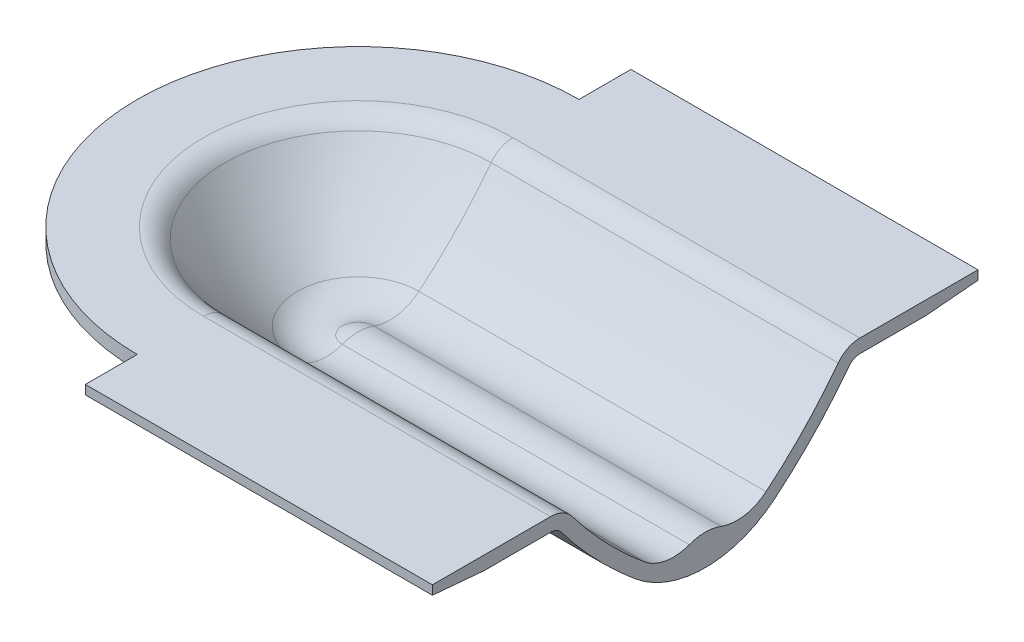
ISO-10303-21;
HEADER;
FILE_DESCRIPTION(('STEP AP214'),'2;1');
FILE_NAME('part.step','',(''),(''),'','','');
FILE_SCHEMA(('AUTOMOTIVE_DESIGN { 1 0 10303 214 1 1 1 1 }'));
ENDSEC;
DATA;
#1=APPLICATION_CONTEXT('core data for automotive mechanical design processes');
#2=APPLICATION_PROTOCOL_DEFINITION('international standard','automotive_design',2000,#1);
#3=PRODUCT_CONTEXT('',#1,'mechanical');
#4=PRODUCT('Part','Part','',(#3));
#5=PRODUCT_RELATED_PRODUCT_CATEGORY('part','',(#4));
#6=PRODUCT_DEFINITION_FORMATION('','',#4);
#7=PRODUCT_DEFINITION_CONTEXT('part definition',#1,'design');
#8=PRODUCT_DEFINITION('design','',#6,#7);
#9=PRODUCT_DEFINITION_SHAPE('','',#8);
#10=(LENGTH_UNIT() NAMED_UNIT(*) SI_UNIT(.MILLI.,.METRE.));
#11=(NAMED_UNIT(*) PLANE_ANGLE_UNIT() SI_UNIT($,.RADIAN.));
#12=(NAMED_UNIT(*) SI_UNIT($,.STERADIAN.) SOLID_ANGLE_UNIT());
#13=UNCERTAINTY_MEASURE_WITH_UNIT(LENGTH_MEASURE(1.E-05),#10,'distance_accuracy_value','');
#14=(GEOMETRIC_REPRESENTATION_CONTEXT(3) GLOBAL_UNCERTAINTY_ASSIGNED_CONTEXT((#13)) GLOBAL_UNIT_ASSIGNED_CONTEXT((#10,
#11,#12)) REPRESENTATION_CONTEXT('',''));
#15=CARTESIAN_POINT('',(0.,0.,0.));
#16=DIRECTION('',(0.,0.,1.));
#17=DIRECTION('',(1.,0.,0.));
#18=AXIS2_PLACEMENT_3D('',#15,#16,#17);
#19=CARTESIAN_POINT('',(-381.999999999999,-30.,-170.25));
#20=DIRECTION('',(1.,0.,0.));
#21=DIRECTION('',(0.,0.,-1.));
#22=AXIS2_PLACEMENT_3D('',#19,#20,#21);
#23=PLANE('',#22);
#24=DIRECTION('',(0.,-1.,0.));
#25=VECTOR('',#24,1.);
#26=CARTESIAN_POINT('',(-381.999999999999,-14.9999999999992,243.099738486189));
#27=LINE('',#26,#25);
#28=CARTESIAN_POINT('',(-381.999999999999,8.00368661311568E-13,243.099738486189));
#29=VERTEX_POINT('',#28);
#30=CARTESIAN_POINT('',(-381.999999999999,-14.9999999999992,243.099738486189));
#31=VERTEX_POINT('',#30);
#32=EDGE_CURVE('E369',#29,#31,#27,.T.);
#33=ORIENTED_EDGE('',*,*,#32,.T.);
#34=DIRECTION('',(0.,-0.0871557427476512,-0.996194698091746));
#35=VECTOR('',#34,1.);
#36=CARTESIAN_POINT('',(-381.999999999999,-10.,300.25));
#37=LINE('',#36,#35);
#38=CARTESIAN_POINT('',(-381.999999999999,-10.,300.25));
#39=VERTEX_POINT('',#38);
#40=EDGE_CURVE('E162',#39,#31,#37,.T.);
#41=ORIENTED_EDGE('',*,*,#40,.F.);
#42=DIRECTION('',(0.,-1.,0.));
#43=VECTOR('',#42,1.);
#44=CARTESIAN_POINT('',(-381.999999999999,0.,300.25));
#45=LINE('',#44,#43);
#46=CARTESIAN_POINT('',(-381.999999999999,0.,300.25));
#47=VERTEX_POINT('',#46);
#48=EDGE_CURVE('E148',#47,#39,#45,.T.);
#49=ORIENTED_EDGE('',*,*,#48,.F.);
#50=DIRECTION('',(0.,0.,1.));
#51=VECTOR('',#50,1.);
#52=CARTESIAN_POINT('',(-381.999999999999,0.,170.25));
#53=LINE('',#52,#51);
#54=EDGE_CURVE('E136',#29,#47,#53,.T.);
#55=ORIENTED_EDGE('',*,*,#54,.F.);
#56=EDGE_LOOP('',(#33,#41,#49,#55));
#57=FACE_BOUND('',#56,.T.);
#58=ADVANCED_FACE('F33',(#57),#23,.F.);
#59=DIRECTION('',(0.,-1.,0.));
#60=VECTOR('',#59,1.);
#61=CARTESIAN_POINT('',(-381.999999999999,-14.9999999999992,-243.099738486189));
#62=LINE('',#61,#60);
#63=CARTESIAN_POINT('',(-381.999999999999,7.99240294431249E-13,-243.099738486189));
#64=VERTEX_POINT('',#63);
#65=CARTESIAN_POINT('',(-381.999999999999,-14.9999999999992,-243.099738486189));
#66=VERTEX_POINT('',#65);
#67=EDGE_CURVE('E287',#64,#66,#62,.T.);
#68=ORIENTED_EDGE('',*,*,#67,.F.);
#69=DIRECTION('',(0.,0.,1.));
#70=VECTOR('',#69,1.);
#71=CARTESIAN_POINT('',(-381.999999999999,0.,-300.25));
#72=LINE('',#71,#70);
#73=CARTESIAN_POINT('',(-381.999999999999,0.,-300.25));
#74=VERTEX_POINT('',#73);
#75=EDGE_CURVE('E288',#74,#64,#72,.T.);
#76=ORIENTED_EDGE('',*,*,#75,.F.);
#77=DIRECTION('',(0.,1.,0.));
#78=VECTOR('',#77,1.);
#79=CARTESIAN_POINT('',(-381.999999999999,0.,-300.25));
#80=LINE('',#79,#78);
#81=CARTESIAN_POINT('',(-381.999999999999,-10.,-300.25));
#82=VERTEX_POINT('',#81);
#83=EDGE_CURVE('E240',#82,#74,#80,.T.);
#84=ORIENTED_EDGE('',*,*,#83,.F.);
#85=DIRECTION('',(0.,0.0871557427476585,-0.996194698091746));
#86=VECTOR('',#85,1.);
#87=CARTESIAN_POINT('',(-381.999999999999,-10.,-300.25));
#88=LINE('',#87,#86);
#89=EDGE_CURVE('E182',#66,#82,#88,.T.);
#90=ORIENTED_EDGE('',*,*,#89,.F.);
#91=EDGE_LOOP('',(#68,#76,#84,#90));
#92=FACE_BOUND('',#91,.T.);
#93=ADVANCED_FACE('F285',(#92),#23,.F.);
#94=CARTESIAN_POINT('',(-381.999999999999,0.,-300.25));
#95=DIRECTION('',(0.,0.,-1.));
#96=DIRECTION('',(-1.,0.,0.));
#97=AXIS2_PLACEMENT_3D('',#94,#95,#96);
#98=PLANE('',#97);
#99=DIRECTION('',(0.,1.,0.));
#100=VECTOR('',#99,1.);
#101=CARTESIAN_POINT('',(0.,0.,-300.25));
#102=LINE('',#101,#100);
#103=CARTESIAN_POINT('',(0.,-10.,-300.25));
#104=VERTEX_POINT('',#103);
#105=CARTESIAN_POINT('',(0.,0.,-300.25));
#106=VERTEX_POINT('',#105);
#107=EDGE_CURVE('E184',#104,#106,#102,.T.);
#108=ORIENTED_EDGE('',*,*,#107,.F.);
#109=DIRECTION('',(1.,0.,0.));
#110=VECTOR('',#109,1.);
#111=CARTESIAN_POINT('',(-381.999999999999,-10.,-300.25));
#112=LINE('',#111,#110);
#113=EDGE_CURVE('E11',#82,#104,#112,.T.);
#114=ORIENTED_EDGE('',*,*,#113,.F.);
#115=ORIENTED_EDGE('',*,*,#83,.T.);
#116=DIRECTION('',(1.,0.,0.));
#117=VECTOR('',#116,1.);
#118=CARTESIAN_POINT('',(-381.999999999999,0.,-300.25));
#119=LINE('',#118,#117);
#120=EDGE_CURVE('E37',#74,#106,#119,.T.);
#121=ORIENTED_EDGE('',*,*,#120,.T.);
#122=EDGE_LOOP('',(#108,#114,#115,#121));
#123=FACE_BOUND('',#122,.T.);
#124=ADVANCED_FACE('F35',(#123),#98,.T.);
#125=CARTESIAN_POINT('',(-381.999999999999,-10.,-300.25));
#126=DIRECTION('',(0.,-0.996194698091746,-0.0871557427476585));
#127=DIRECTION('',(0.,0.0871557427476585,-0.996194698091746));
#128=AXIS2_PLACEMENT_3D('',#125,#126,#127);
#129=PLANE('',#128);
#130=DIRECTION('',(0.,0.0871557427476585,-0.996194698091746));
#131=VECTOR('',#130,1.);
#132=CARTESIAN_POINT('',(0.,-10.,-300.25));
#133=LINE('',#132,#131);
#134=CARTESIAN_POINT('',(0.,-15.,-243.099738486193));
#135=VERTEX_POINT('',#134);
#136=EDGE_CURVE('E238',#135,#104,#133,.T.);
#137=ORIENTED_EDGE('',*,*,#136,.F.);
#138=DIRECTION('',(1.,0.,0.));
#139=VECTOR('',#138,1.);
#140=CARTESIAN_POINT('',(-381.999999999999,-15.,-243.099738486193));
#141=LINE('',#140,#139);
#142=EDGE_CURVE('E43',#66,#135,#141,.T.);
#143=ORIENTED_EDGE('',*,*,#142,.F.);
#144=ORIENTED_EDGE('',*,*,#89,.T.);
#145=ORIENTED_EDGE('',*,*,#113,.T.);
#146=EDGE_LOOP('',(#137,#143,#144,#145));
#147=FACE_BOUND('',#146,.T.);
#148=ADVANCED_FACE('F277',(#147),#129,.T.);
#149=CARTESIAN_POINT('',(-381.999999999999,-15.,-243.099738486193));
#150=DIRECTION('',(0.,-1.,0.));
#151=DIRECTION('',(0.,0.,-1.));
#152=AXIS2_PLACEMENT_3D('',#149,#150,#151);
#153=PLANE('',#152);
#154=DIRECTION('',(0.,0.,-1.));
#155=VECTOR('',#154,1.);
#156=CARTESIAN_POINT('',(0.,-15.,-243.099738486193));
#157=LINE('',#156,#155);
#158=CARTESIAN_POINT('',(0.,-15.,-170.25));
#159=VERTEX_POINT('',#158);
#160=EDGE_CURVE('E236',#159,#135,#157,.T.);
#161=ORIENTED_EDGE('',*,*,#160,.F.);
#162=DIRECTION('',(1.,0.,0.));
#163=VECTOR('',#162,1.);
#164=CARTESIAN_POINT('',(-381.999999999999,-15.,-170.25));
#165=LINE('',#164,#163);
#166=CARTESIAN_POINT('',(-381.999999999999,-14.9999999999979,-170.25));
#167=VERTEX_POINT('',#166);
#168=EDGE_CURVE('E243',#167,#159,#165,.T.);
#169=ORIENTED_EDGE('',*,*,#168,.F.);
#170=CARTESIAN_POINT('',(-382.,-14.9999999999979,0.));
#171=DIRECTION('',(0.,-1.,0.));
#172=DIRECTION('',(1.,0.,0.));
#173=AXIS2_PLACEMENT_3D('',#170,#171,#172);
#174=CIRCLE('',#173,170.25);
#175=CARTESIAN_POINT('',(-381.999999999999,-14.9999999999979,170.25));
#176=VERTEX_POINT('',#175);
#177=EDGE_CURVE('E466',#176,#167,#174,.T.);
#178=ORIENTED_EDGE('',*,*,#177,.F.);
#179=DIRECTION('',(1.,0.,0.));
#180=VECTOR('',#179,1.);
#181=CARTESIAN_POINT('',(-381.999999999999,-14.9999999999971,170.25));
#182=LINE('',#181,#180);
#183=CARTESIAN_POINT('',(0.,-14.9999999999971,170.25));
#184=VERTEX_POINT('',#183);
#185=EDGE_CURVE('E253',#176,#184,#182,.T.);
#186=ORIENTED_EDGE('',*,*,#185,.T.);
#187=DIRECTION('',(0.,0.,-1.));
#188=VECTOR('',#187,1.);
#189=CARTESIAN_POINT('',(0.,-14.9999999999971,170.25));
#190=LINE('',#189,#188);
#191=CARTESIAN_POINT('',(0.,-15.,243.099738486189));
#192=VERTEX_POINT('',#191);
#193=EDGE_CURVE('E218',#192,#184,#190,.T.);
#194=ORIENTED_EDGE('',*,*,#193,.F.);
#195=DIRECTION('',(1.,0.,0.));
#196=VECTOR('',#195,1.);
#197=CARTESIAN_POINT('',(-381.999999999999,-15.,243.099738486189));
#198=LINE('',#197,#196);
#199=EDGE_CURVE('E255',#31,#192,#198,.T.);
#200=ORIENTED_EDGE('',*,*,#199,.F.);
#201=CARTESIAN_POINT('',(-382.,-14.9999999999992,0.));
#202=DIRECTION('',(0.,-1.,0.));
#203=DIRECTION('',(1.,0.,0.));
#204=AXIS2_PLACEMENT_3D('',#201,#202,#203);
#205=CIRCLE('',#204,243.099738486189);
#206=EDGE_CURVE('E469',#31,#66,#205,.T.);
#207=ORIENTED_EDGE('',*,*,#206,.T.);
#208=ORIENTED_EDGE('',*,*,#142,.T.);
#209=EDGE_LOOP('',(#161,#169,#178,#186,#194,#200,#207,#208));
#210=FACE_BOUND('',#209,.T.);
#211=ADVANCED_FACE('F404',(#210),#153,.T.);
#212=CARTESIAN_POINT('',(-381.999999999999,-30.,-170.25));
#213=DIRECTION('',(1.,0.,0.));
#214=DIRECTION('',(0.,0.,-1.));
#215=AXIS2_PLACEMENT_3D('',#212,#213,#214);
#216=CYLINDRICAL_SURFACE('',#215,15.);
#217=CARTESIAN_POINT('',(0.,-30.,-170.25));
#218=DIRECTION('',(-1.,0.,0.));
#219=DIRECTION('',(0.,0.,-1.));
#220=AXIS2_PLACEMENT_3D('',#217,#218,#219);
#221=CIRCLE('',#220,15.);
#222=CARTESIAN_POINT('',(0.,-20.9378309151861,-158.296879425094));
#223=VERTEX_POINT('',#222);
#224=EDGE_CURVE('E233',#223,#159,#221,.T.);
#225=ORIENTED_EDGE('',*,*,#224,.F.);
#226=DIRECTION('',(1.,0.,0.));
#227=VECTOR('',#226,1.);
#228=CARTESIAN_POINT('',(-381.999999999999,-20.9378309151861,-158.296879425094));
#229=LINE('',#228,#227);
#230=CARTESIAN_POINT('',(-381.999999999999,-20.9378309151853,-158.296879425093));
#231=VERTEX_POINT('',#230);
#232=EDGE_CURVE('E245',#231,#223,#229,.T.);
#233=ORIENTED_EDGE('',*,*,#232,.F.);
#234=CARTESIAN_POINT('',(-381.999999999999,-30.,-170.25));
#235=DIRECTION('',(-1.,0.,0.));
#236=DIRECTION('',(0.,0.,-1.));
#237=AXIS2_PLACEMENT_3D('',#234,#235,#236);
#238=CIRCLE('',#237,15.);
#239=EDGE_CURVE('E179',#231,#167,#238,.T.);
#240=ORIENTED_EDGE('',*,*,#239,.T.);
#241=ORIENTED_EDGE('',*,*,#168,.T.);
#242=EDGE_LOOP('',(#225,#233,#240,#241));
#243=FACE_BOUND('',#242,.T.);
#244=ADVANCED_FACE('F407',(#243),#216,.F.);
#245=CARTESIAN_POINT('',(-381.999999999999,290.196640996754,252.093593646685));
#246=DIRECTION('',(1.,0.,0.));
#247=DIRECTION('',(0.,0.,-1.));
#248=AXIS2_PLACEMENT_3D('',#245,#246,#247);
#249=CYLINDRICAL_SURFACE('',#248,515.);
#250=CARTESIAN_POINT('',(0.,290.196640996754,252.093593646685));
#251=DIRECTION('',(1.,0.,0.));
#252=DIRECTION('',(0.,0.,1.));
#253=AXIS2_PLACEMENT_3D('',#250,#251,#252);
#254=CIRCLE('',#253,515.);
#255=CARTESIAN_POINT('',(0.,-106.378160282581,-76.4690746378544));
#256=VERTEX_POINT('',#255);
#257=EDGE_CURVE('E230',#256,#223,#254,.T.);
#258=ORIENTED_EDGE('',*,*,#257,.F.);
#259=DIRECTION('',(1.,0.,0.));
#260=VECTOR('',#259,1.);
#261=CARTESIAN_POINT('',(-381.999999999999,-106.378160282581,-76.4690746378544));
#262=LINE('',#261,#260);
#263=CARTESIAN_POINT('',(-381.999999999999,-106.378160282581,-76.4690746378548));
#264=VERTEX_POINT('',#263);
#265=EDGE_CURVE('E247',#264,#256,#262,.T.);
#266=ORIENTED_EDGE('',*,*,#265,.F.);
#267=CARTESIAN_POINT('',(-381.999999999999,290.196640996754,252.093593646685));
#268=DIRECTION('',(1.,0.,0.));
#269=DIRECTION('',(0.,0.,1.));
#270=AXIS2_PLACEMENT_3D('',#267,#268,#269);
#271=CIRCLE('',#270,515.);
#272=EDGE_CURVE('E176',#264,#231,#271,.T.);
#273=ORIENTED_EDGE('',*,*,#272,.T.);
#274=ORIENTED_EDGE('',*,*,#232,.T.);
#275=EDGE_LOOP('',(#258,#266,#273,#274));
#276=FACE_BOUND('',#275,.T.);
#277=ADVANCED_FACE('F410',(#276),#249,.T.);
#278=CARTESIAN_POINT('',(-381.999999999999,-14.0800661720858,0.));
#279=DIRECTION('',(1.,0.,0.));
#280=DIRECTION('',(0.,0.,-1.));
#281=AXIS2_PLACEMENT_3D('',#278,#279,#280);
#282=CYLINDRICAL_SURFACE('',#281,119.8601583196);
#283=CARTESIAN_POINT('',(0.,-14.0800661720858,0.));
#284=DIRECTION('',(1.,0.,0.));
#285=DIRECTION('',(0.,0.,1.));
#286=AXIS2_PLACEMENT_3D('',#283,#284,#285);
#287=CIRCLE('',#286,119.8601583196);
#288=CARTESIAN_POINT('',(0.,-106.378160282581,76.4690746378544));
#289=VERTEX_POINT('',#288);
#290=EDGE_CURVE('E227',#289,#256,#287,.T.);
#291=ORIENTED_EDGE('',*,*,#290,.F.);
#292=DIRECTION('',(1.,0.,0.));
#293=VECTOR('',#292,1.);
#294=CARTESIAN_POINT('',(-381.999999999999,-106.378160282581,76.4690746378544));
#295=LINE('',#294,#293);
#296=CARTESIAN_POINT('',(-381.999999999999,-106.378160282581,76.4690746378548));
#297=VERTEX_POINT('',#296);
#298=EDGE_CURVE('E249',#297,#289,#295,.T.);
#299=ORIENTED_EDGE('',*,*,#298,.F.);
#300=CARTESIAN_POINT('',(-381.999999999999,-14.0800661720858,0.));
#301=DIRECTION('',(1.,0.,0.));
#302=DIRECTION('',(0.,0.,1.));
#303=AXIS2_PLACEMENT_3D('',#300,#301,#302);
#304=CIRCLE('',#303,119.8601583196);
#305=EDGE_CURVE('E173',#297,#264,#304,.T.);
#306=ORIENTED_EDGE('',*,*,#305,.T.);
#307=ORIENTED_EDGE('',*,*,#265,.T.);
#308=EDGE_LOOP('',(#291,#299,#306,#307));
#309=FACE_BOUND('',#308,.T.);
#310=ADVANCED_FACE('F414',(#309),#282,.T.);
#311=CARTESIAN_POINT('',(-381.999999999999,290.196640996754,-252.093593646685));
#312=DIRECTION('',(1.,0.,0.));
#313=DIRECTION('',(0.,0.,-1.));
#314=AXIS2_PLACEMENT_3D('',#311,#312,#313);
#315=CYLINDRICAL_SURFACE('',#314,515.);
#316=CARTESIAN_POINT('',(0.,290.196640996754,-252.093593646685));
#317=DIRECTION('',(1.,0.,0.));
#318=DIRECTION('',(0.,0.,1.));
#319=AXIS2_PLACEMENT_3D('',#316,#317,#318);
#320=CIRCLE('',#319,515.);
#321=CARTESIAN_POINT('',(0.,-20.9378309151852,158.296879425093));
#322=VERTEX_POINT('',#321);
#323=EDGE_CURVE('E224',#322,#289,#320,.T.);
#324=ORIENTED_EDGE('',*,*,#323,.F.);
#325=DIRECTION('',(1.,0.,0.));
#326=VECTOR('',#325,1.);
#327=CARTESIAN_POINT('',(-381.999999999999,-20.9378309151852,158.296879425093));
#328=LINE('',#327,#326);
#329=CARTESIAN_POINT('',(-381.999999999999,-20.9378309151853,158.296879425093));
#330=VERTEX_POINT('',#329);
#331=EDGE_CURVE('E251',#330,#322,#328,.T.);
#332=ORIENTED_EDGE('',*,*,#331,.F.);
#333=CARTESIAN_POINT('',(-381.999999999999,290.196640996754,-252.093593646685));
#334=DIRECTION('',(1.,0.,0.));
#335=DIRECTION('',(0.,0.,1.));
#336=AXIS2_PLACEMENT_3D('',#333,#334,#335);
#337=CIRCLE('',#336,515.);
#338=EDGE_CURVE('E170',#330,#297,#337,.T.);
#339=ORIENTED_EDGE('',*,*,#338,.T.);
#340=ORIENTED_EDGE('',*,*,#298,.T.);
#341=EDGE_LOOP('',(#324,#332,#339,#340));
#342=FACE_BOUND('',#341,.T.);
#343=ADVANCED_FACE('F418',(#342),#315,.T.);
#344=CARTESIAN_POINT('',(-381.999999999999,-30.,170.25));
#345=DIRECTION('',(1.,0.,0.));
#346=DIRECTION('',(0.,0.,-1.));
#347=AXIS2_PLACEMENT_3D('',#344,#345,#346);
#348=CYLINDRICAL_SURFACE('',#347,15.0000000000014);
#349=CARTESIAN_POINT('',(0.,-30.,170.25));
#350=DIRECTION('',(-1.,0.,0.));
#351=DIRECTION('',(0.,0.,1.));
#352=AXIS2_PLACEMENT_3D('',#349,#350,#351);
#353=CIRCLE('',#352,15.0000000000014);
#354=EDGE_CURVE('E221',#184,#322,#353,.T.);
#355=ORIENTED_EDGE('',*,*,#354,.F.);
#356=ORIENTED_EDGE('',*,*,#185,.F.);
#357=CARTESIAN_POINT('',(-381.999999999999,-30.,170.25));
#358=DIRECTION('',(-1.,0.,0.));
#359=DIRECTION('',(0.,0.,1.));
#360=AXIS2_PLACEMENT_3D('',#357,#358,#359);
#361=CIRCLE('',#360,15.0000000000014);
#362=EDGE_CURVE('E164',#176,#330,#361,.T.);
#363=ORIENTED_EDGE('',*,*,#362,.T.);
#364=ORIENTED_EDGE('',*,*,#331,.T.);
#365=EDGE_LOOP('',(#355,#356,#363,#364));
#366=FACE_BOUND('',#365,.T.);
#367=ADVANCED_FACE('F422',(#366),#348,.F.);
#368=CARTESIAN_POINT('',(-381.999999999999,-10.,300.25));
#369=DIRECTION('',(0.,-0.996194698091746,0.0871557427476512));
#370=DIRECTION('',(0.,-0.0871557427476512,-0.996194698091746));
#371=AXIS2_PLACEMENT_3D('',#368,#369,#370);
#372=PLANE('',#371);
#373=DIRECTION('',(0.,-0.0871557427476512,-0.996194698091746));
#374=VECTOR('',#373,1.);
#375=CARTESIAN_POINT('',(0.,-10.,300.25));
#376=LINE('',#375,#374);
#377=CARTESIAN_POINT('',(0.,-10.,300.25));
#378=VERTEX_POINT('',#377);
#379=EDGE_CURVE('E215',#378,#192,#376,.T.);
#380=ORIENTED_EDGE('',*,*,#379,.F.);
#381=DIRECTION('',(1.,0.,0.));
#382=VECTOR('',#381,1.);
#383=CARTESIAN_POINT('',(-381.999999999999,-10.,300.25));
#384=LINE('',#383,#382);
#385=EDGE_CURVE('E157',#39,#378,#384,.T.);
#386=ORIENTED_EDGE('',*,*,#385,.F.);
#387=ORIENTED_EDGE('',*,*,#40,.T.);
#388=ORIENTED_EDGE('',*,*,#199,.T.);
#389=EDGE_LOOP('',(#380,#386,#387,#388));
#390=FACE_BOUND('',#389,.T.);
#391=ADVANCED_FACE('F426',(#390),#372,.T.);
#392=CARTESIAN_POINT('',(-381.999999999999,0.,300.25));
#393=DIRECTION('',(0.,0.,1.));
#394=DIRECTION('',(1.,0.,0.));
#395=AXIS2_PLACEMENT_3D('',#392,#393,#394);
#396=PLANE('',#395);
#397=DIRECTION('',(0.,-1.,0.));
#398=VECTOR('',#397,1.);
#399=CARTESIAN_POINT('',(0.,0.,300.25));
#400=LINE('',#399,#398);
#401=CARTESIAN_POINT('',(0.,0.,300.25));
#402=VERTEX_POINT('',#401);
#403=EDGE_CURVE('E155',#402,#378,#400,.T.);
#404=ORIENTED_EDGE('',*,*,#403,.F.);
#405=DIRECTION('',(1.,0.,0.));
#406=VECTOR('',#405,1.);
#407=CARTESIAN_POINT('',(-381.999999999999,0.,300.25));
#408=LINE('',#407,#406);
#409=EDGE_CURVE('E139',#47,#402,#408,.T.);
#410=ORIENTED_EDGE('',*,*,#409,.F.);
#411=ORIENTED_EDGE('',*,*,#48,.T.);
#412=ORIENTED_EDGE('',*,*,#385,.T.);
#413=EDGE_LOOP('',(#404,#410,#411,#412));
#414=FACE_BOUND('',#413,.T.);
#415=ADVANCED_FACE('F153',(#414),#396,.T.);
#416=CARTESIAN_POINT('',(-381.999999999999,0.,220.25));
#417=DIRECTION('',(0.,1.,0.));
#418=DIRECTION('',(0.,0.,1.));
#419=AXIS2_PLACEMENT_3D('',#416,#417,#418);
#420=PLANE('',#419);
#421=DIRECTION('',(0.,0.,1.));
#422=VECTOR('',#421,1.);
#423=CARTESIAN_POINT('',(0.,0.,220.25));
#424=LINE('',#423,#422);
#425=CARTESIAN_POINT('',(0.,0.,170.25));
#426=VERTEX_POINT('',#425);
#427=EDGE_CURVE('E212',#426,#402,#424,.T.);
#428=ORIENTED_EDGE('',*,*,#427,.F.);
#429=DIRECTION('',(1.,0.,0.));
#430=VECTOR('',#429,1.);
#431=CARTESIAN_POINT('',(-381.999999999999,0.,170.25));
#432=LINE('',#431,#430);
#433=CARTESIAN_POINT('',(-381.999999999999,6.07171760307322E-13,170.25));
#434=VERTEX_POINT('',#433);
#435=EDGE_CURVE('E158',#434,#426,#432,.T.);
#436=ORIENTED_EDGE('',*,*,#435,.F.);
#437=CARTESIAN_POINT('',(-382.,6.10622663543836E-13,0.));
#438=DIRECTION('',(0.,-1.,0.));
#439=DIRECTION('',(1.,0.,0.));
#440=AXIS2_PLACEMENT_3D('',#437,#438,#439);
#441=CIRCLE('',#440,170.25);
#442=CARTESIAN_POINT('',(-381.999999999999,6.06043393427003E-13,-170.25));
#443=VERTEX_POINT('',#442);
#444=EDGE_CURVE('E328',#434,#443,#441,.T.);
#445=ORIENTED_EDGE('',*,*,#444,.T.);
#446=DIRECTION('',(1.,0.,0.));
#447=VECTOR('',#446,1.);
#448=CARTESIAN_POINT('',(-381.999999999999,0.,-170.25));
#449=LINE('',#448,#447);
#450=CARTESIAN_POINT('',(0.,0.,-170.25));
#451=VERTEX_POINT('',#450);
#452=EDGE_CURVE('E271',#443,#451,#449,.T.);
#453=ORIENTED_EDGE('',*,*,#452,.T.);
#454=DIRECTION('',(0.,0.,1.));
#455=VECTOR('',#454,1.);
#456=CARTESIAN_POINT('',(0.,0.,-300.25));
#457=LINE('',#456,#455);
#458=EDGE_CURVE('E187',#106,#451,#457,.T.);
#459=ORIENTED_EDGE('',*,*,#458,.F.);
#460=ORIENTED_EDGE('',*,*,#120,.F.);
#461=ORIENTED_EDGE('',*,*,#75,.T.);
#462=CARTESIAN_POINT('',(-382.,8.04911692853238E-13,0.));
#463=DIRECTION('',(0.,-1.,0.));
#464=DIRECTION('',(1.,0.,0.));
#465=AXIS2_PLACEMENT_3D('',#462,#463,#464);
#466=CIRCLE('',#465,243.099738486189);
#467=EDGE_CURVE('E143',#29,#64,#466,.T.);
#468=ORIENTED_EDGE('',*,*,#467,.F.);
#469=ORIENTED_EDGE('',*,*,#54,.T.);
#470=ORIENTED_EDGE('',*,*,#409,.T.);
#471=EDGE_LOOP('',(#428,#436,#445,#453,#459,#460,#461,#468,#469,#470));
#472=FACE_BOUND('',#471,.T.);
#473=ADVANCED_FACE('F138',(#472),#420,.T.);
#474=CARTESIAN_POINT('',(-381.999999999999,-30.,170.25));
#475=DIRECTION('',(1.,0.,0.));
#476=DIRECTION('',(0.,0.,-1.));
#477=AXIS2_PLACEMENT_3D('',#474,#475,#476);
#478=CYLINDRICAL_SURFACE('',#477,30.);
#479=CARTESIAN_POINT('',(0.,-30.,170.25));
#480=DIRECTION('',(1.,0.,0.));
#481=DIRECTION('',(0.,0.,1.));
#482=AXIS2_PLACEMENT_3D('',#479,#480,#481);
#483=CIRCLE('',#482,30.);
#484=CARTESIAN_POINT('',(0.,-11.8756618303724,146.343758850187));
#485=VERTEX_POINT('',#484);
#486=EDGE_CURVE('E209',#485,#426,#483,.T.);
#487=ORIENTED_EDGE('',*,*,#486,.F.);
#488=DIRECTION('',(1.,0.,0.));
#489=VECTOR('',#488,1.);
#490=CARTESIAN_POINT('',(-381.999999999999,-11.8756618303724,146.343758850187));
#491=LINE('',#490,#489);
#492=CARTESIAN_POINT('',(-381.999999999999,-11.875661830372,146.343758850187));
#493=VERTEX_POINT('',#492);
#494=EDGE_CURVE('E260',#493,#485,#491,.T.);
#495=ORIENTED_EDGE('',*,*,#494,.F.);
#496=CARTESIAN_POINT('',(-381.999999999999,-30.,170.25));
#497=DIRECTION('',(1.,0.,0.));
#498=DIRECTION('',(0.,0.,1.));
#499=AXIS2_PLACEMENT_3D('',#496,#497,#498);
#500=CIRCLE('',#499,30.);
#501=EDGE_CURVE('E149',#493,#434,#500,.T.);
#502=ORIENTED_EDGE('',*,*,#501,.T.);
#503=ORIENTED_EDGE('',*,*,#435,.T.);
#504=EDGE_LOOP('',(#487,#495,#502,#503));
#505=FACE_BOUND('',#504,.T.);
#506=ADVANCED_FACE('F316',(#505),#478,.T.);
#507=CARTESIAN_POINT('',(-381.999999999999,290.196640996754,-252.093593646685));
#508=DIRECTION('',(1.,0.,0.));
#509=DIRECTION('',(0.,0.,-1.));
#510=AXIS2_PLACEMENT_3D('',#507,#508,#509);
#511=CYLINDRICAL_SURFACE('',#510,500.);
#512=CARTESIAN_POINT('',(0.,290.196640996754,-252.093593646685));
#513=DIRECTION('',(-1.,0.,0.));
#514=DIRECTION('',(0.,0.,1.));
#515=AXIS2_PLACEMENT_3D('',#512,#513,#514);
#516=CIRCLE('',#515,500.);
#517=CARTESIAN_POINT('',(0.,-94.8274379152218,66.8992881829652));
#518=VERTEX_POINT('',#517);
#519=EDGE_CURVE('E206',#518,#485,#516,.T.);
#520=ORIENTED_EDGE('',*,*,#519,.F.);
#521=DIRECTION('',(1.,0.,0.));
#522=VECTOR('',#521,1.);
#523=CARTESIAN_POINT('',(-381.999999999999,-94.8274379152218,66.8992881829652));
#524=LINE('',#523,#522);
#525=CARTESIAN_POINT('',(-381.999999999999,-94.8274379152217,66.8992881829655));
#526=VERTEX_POINT('',#525);
#527=EDGE_CURVE('E262',#526,#518,#524,.T.);
#528=ORIENTED_EDGE('',*,*,#527,.F.);
#529=CARTESIAN_POINT('',(-381.999999999999,290.196640996754,-252.093593646685));
#530=DIRECTION('',(-1.,0.,0.));
#531=DIRECTION('',(0.,0.,1.));
#532=AXIS2_PLACEMENT_3D('',#529,#530,#531);
#533=CIRCLE('',#532,500.);
#534=EDGE_CURVE('E308',#526,#493,#533,.T.);
#535=ORIENTED_EDGE('',*,*,#534,.T.);
#536=ORIENTED_EDGE('',*,*,#494,.T.);
#537=EDGE_LOOP('',(#520,#528,#535,#536));
#538=FACE_BOUND('',#537,.T.);
#539=ADVANCED_FACE('F373',(#538),#511,.F.);
#540=CARTESIAN_POINT('',(-381.999999999999,-56.325030024024,35.));
#541=DIRECTION('',(1.,0.,0.));
#542=DIRECTION('',(0.,0.,-1.));
#543=AXIS2_PLACEMENT_3D('',#540,#541,#542);
#544=CYLINDRICAL_SURFACE('',#543,50.0000000000003);
#545=CARTESIAN_POINT('',(0.,-56.325030024024,35.));
#546=DIRECTION('',(-1.,0.,0.));
#547=DIRECTION('',(0.,0.,1.));
#548=AXIS2_PLACEMENT_3D('',#545,#546,#547);
#549=CIRCLE('',#548,50.0000000000003);
#550=CARTESIAN_POINT('',(0.,-103.162515012012,17.4999999999984));
#551=VERTEX_POINT('',#550);
#552=EDGE_CURVE('E203',#551,#518,#549,.T.);
#553=ORIENTED_EDGE('',*,*,#552,.F.);
#554=DIRECTION('',(1.,0.,0.));
#555=VECTOR('',#554,1.);
#556=CARTESIAN_POINT('',(-381.999999999999,-103.162515012012,17.4999999999984));
#557=LINE('',#556,#555);
#558=CARTESIAN_POINT('',(-381.999999999999,-103.162515012012,17.4999999999986));
#559=VERTEX_POINT('',#558);
#560=EDGE_CURVE('E264',#559,#551,#557,.T.);
#561=ORIENTED_EDGE('',*,*,#560,.F.);
#562=CARTESIAN_POINT('',(-381.999999999999,-56.325030024024,35.));
#563=DIRECTION('',(-1.,0.,0.));
#564=DIRECTION('',(0.,0.,1.));
#565=AXIS2_PLACEMENT_3D('',#562,#563,#564);
#566=CIRCLE('',#565,50.0000000000003);
#567=EDGE_CURVE('E305',#559,#526,#566,.T.);
#568=ORIENTED_EDGE('',*,*,#567,.T.);
#569=ORIENTED_EDGE('',*,*,#527,.T.);
#570=EDGE_LOOP('',(#553,#561,#568,#569));
#571=FACE_BOUND('',#570,.T.);
#572=ADVANCED_FACE('F361',(#571),#544,.F.);
#573=CARTESIAN_POINT('',(-381.999999999999,-150.,0.));
#574=DIRECTION('',(1.,0.,0.));
#575=DIRECTION('',(0.,0.,-1.));
#576=AXIS2_PLACEMENT_3D('',#573,#574,#575);
#577=CYLINDRICAL_SURFACE('',#576,49.9999999999994);
#578=CARTESIAN_POINT('',(0.,-150.,0.));
#579=DIRECTION('',(1.,0.,0.));
#580=DIRECTION('',(0.,0.,-1.));
#581=AXIS2_PLACEMENT_3D('',#578,#579,#580);
#582=CIRCLE('',#581,49.9999999999994);
#583=CARTESIAN_POINT('',(0.,-103.162515012012,-17.4999999999985));
#584=VERTEX_POINT('',#583);
#585=EDGE_CURVE('E200',#584,#551,#582,.T.);
#586=ORIENTED_EDGE('',*,*,#585,.F.);
#587=DIRECTION('',(1.,0.,0.));
#588=VECTOR('',#587,1.);
#589=CARTESIAN_POINT('',(-381.999999999999,-103.162515012012,-17.4999999999985));
#590=LINE('',#589,#588);
#591=CARTESIAN_POINT('',(-381.999999999999,-103.162515012012,-17.4999999999985));
#592=VERTEX_POINT('',#591);
#593=EDGE_CURVE('E266',#592,#584,#590,.T.);
#594=ORIENTED_EDGE('',*,*,#593,.F.);
#595=CARTESIAN_POINT('',(-381.999999999999,-150.,0.));
#596=DIRECTION('',(1.,0.,0.));
#597=DIRECTION('',(0.,0.,-1.));
#598=AXIS2_PLACEMENT_3D('',#595,#596,#597);
#599=CIRCLE('',#598,49.9999999999994);
#600=EDGE_CURVE('E302',#592,#559,#599,.T.);
#601=ORIENTED_EDGE('',*,*,#600,.T.);
#602=ORIENTED_EDGE('',*,*,#560,.T.);
#603=EDGE_LOOP('',(#586,#594,#601,#602));
#604=FACE_BOUND('',#603,.T.);
#605=ADVANCED_FACE('F378',(#604),#577,.T.);
#606=CARTESIAN_POINT('',(-381.999999999999,-56.325030024024,-35.));
#607=DIRECTION('',(1.,0.,0.));
#608=DIRECTION('',(0.,0.,-1.));
#609=AXIS2_PLACEMENT_3D('',#606,#607,#608);
#610=CYLINDRICAL_SURFACE('',#609,50.0000000000003);
#611=CARTESIAN_POINT('',(0.,-56.325030024024,-35.));
#612=DIRECTION('',(-1.,0.,0.));
#613=DIRECTION('',(0.,0.,1.));
#614=AXIS2_PLACEMENT_3D('',#611,#612,#613);
#615=CIRCLE('',#614,50.0000000000003);
#616=CARTESIAN_POINT('',(0.,-94.8274379152215,-66.899288182965));
#617=VERTEX_POINT('',#616);
#618=EDGE_CURVE('E197',#617,#584,#615,.T.);
#619=ORIENTED_EDGE('',*,*,#618,.F.);
#620=DIRECTION('',(1.,0.,0.));
#621=VECTOR('',#620,1.);
#622=CARTESIAN_POINT('',(-381.999999999999,-94.8274379152215,-66.899288182965));
#623=LINE('',#622,#621);
#624=CARTESIAN_POINT('',(-381.999999999999,-94.8274379152217,-66.8992881829655));
#625=VERTEX_POINT('',#624);
#626=EDGE_CURVE('E268',#625,#617,#623,.T.);
#627=ORIENTED_EDGE('',*,*,#626,.F.);
#628=CARTESIAN_POINT('',(-381.999999999999,-56.325030024024,-35.));
#629=DIRECTION('',(-1.,0.,0.));
#630=DIRECTION('',(0.,0.,1.));
#631=AXIS2_PLACEMENT_3D('',#628,#629,#630);
#632=CIRCLE('',#631,50.0000000000003);
#633=EDGE_CURVE('E300',#625,#592,#632,.T.);
#634=ORIENTED_EDGE('',*,*,#633,.T.);
#635=ORIENTED_EDGE('',*,*,#593,.T.);
#636=EDGE_LOOP('',(#619,#627,#634,#635));
#637=FACE_BOUND('',#636,.T.);
#638=ADVANCED_FACE('F443',(#637),#610,.F.);
#639=CARTESIAN_POINT('',(-381.999999999999,290.196640996754,252.093593646685));
#640=DIRECTION('',(1.,0.,0.));
#641=DIRECTION('',(0.,0.,-1.));
#642=AXIS2_PLACEMENT_3D('',#639,#640,#641);
#643=CYLINDRICAL_SURFACE('',#642,500.);
#644=CARTESIAN_POINT('',(0.,290.196640996754,252.093593646685));
#645=DIRECTION('',(-1.,0.,0.));
#646=DIRECTION('',(0.,0.,1.));
#647=AXIS2_PLACEMENT_3D('',#644,#645,#646);
#648=CIRCLE('',#647,500.);
#649=CARTESIAN_POINT('',(0.,-11.8756618303724,-146.343758850188));
#650=VERTEX_POINT('',#649);
#651=EDGE_CURVE('E194',#650,#617,#648,.T.);
#652=ORIENTED_EDGE('',*,*,#651,.F.);
#653=DIRECTION('',(1.,0.,0.));
#654=VECTOR('',#653,1.);
#655=CARTESIAN_POINT('',(-381.999999999999,-11.8756618303724,-146.343758850188));
#656=LINE('',#655,#654);
#657=CARTESIAN_POINT('',(-381.999999999999,-11.875661830372,-146.343758850187));
#658=VERTEX_POINT('',#657);
#659=EDGE_CURVE('E270',#658,#650,#656,.T.);
#660=ORIENTED_EDGE('',*,*,#659,.F.);
#661=CARTESIAN_POINT('',(-381.999999999999,290.196640996754,252.093593646685));
#662=DIRECTION('',(-1.,0.,0.));
#663=DIRECTION('',(0.,0.,1.));
#664=AXIS2_PLACEMENT_3D('',#661,#662,#663);
#665=CIRCLE('',#664,500.);
#666=EDGE_CURVE('E297',#658,#625,#665,.T.);
#667=ORIENTED_EDGE('',*,*,#666,.T.);
#668=ORIENTED_EDGE('',*,*,#626,.T.);
#669=EDGE_LOOP('',(#652,#660,#667,#668));
#670=FACE_BOUND('',#669,.T.);
#671=ADVANCED_FACE('F446',(#670),#643,.F.);
#672=CARTESIAN_POINT('',(-381.999999999999,-30.,-170.25));
#673=DIRECTION('',(1.,0.,0.));
#674=DIRECTION('',(0.,0.,-1.));
#675=AXIS2_PLACEMENT_3D('',#672,#673,#674);
#676=CYLINDRICAL_SURFACE('',#675,30.);
#677=CARTESIAN_POINT('',(0.,-30.,-170.25));
#678=DIRECTION('',(1.,0.,0.));
#679=DIRECTION('',(0.,0.,-1.));
#680=AXIS2_PLACEMENT_3D('',#677,#678,#679);
#681=CIRCLE('',#680,30.);
#682=EDGE_CURVE('E191',#451,#650,#681,.T.);
#683=ORIENTED_EDGE('',*,*,#682,.F.);
#684=ORIENTED_EDGE('',*,*,#452,.F.);
#685=CARTESIAN_POINT('',(-381.999999999999,-30.,-170.25));
#686=DIRECTION('',(1.,0.,0.));
#687=DIRECTION('',(0.,0.,-1.));
#688=AXIS2_PLACEMENT_3D('',#685,#686,#687);
#689=CIRCLE('',#688,30.);
#690=EDGE_CURVE('E290',#443,#658,#689,.T.);
#691=ORIENTED_EDGE('',*,*,#690,.T.);
#692=ORIENTED_EDGE('',*,*,#659,.T.);
#693=EDGE_LOOP('',(#683,#684,#691,#692));
#694=FACE_BOUND('',#693,.T.);
#695=ADVANCED_FACE('F401',(#694),#676,.T.);
#696=CARTESIAN_POINT('',(0.,-30.,-170.25));
#697=DIRECTION('',(1.,0.,0.));
#698=DIRECTION('',(0.,0.,-1.));
#699=AXIS2_PLACEMENT_3D('',#696,#697,#698);
#700=PLANE('',#699);
#701=ORIENTED_EDGE('',*,*,#107,.T.);
#702=ORIENTED_EDGE('',*,*,#458,.T.);
#703=ORIENTED_EDGE('',*,*,#682,.T.);
#704=ORIENTED_EDGE('',*,*,#651,.T.);
#705=ORIENTED_EDGE('',*,*,#618,.T.);
#706=ORIENTED_EDGE('',*,*,#585,.T.);
#707=ORIENTED_EDGE('',*,*,#552,.T.);
#708=ORIENTED_EDGE('',*,*,#519,.T.);
#709=ORIENTED_EDGE('',*,*,#486,.T.);
#710=ORIENTED_EDGE('',*,*,#427,.T.);
#711=ORIENTED_EDGE('',*,*,#403,.T.);
#712=ORIENTED_EDGE('',*,*,#379,.T.);
#713=ORIENTED_EDGE('',*,*,#193,.T.);
#714=ORIENTED_EDGE('',*,*,#354,.T.);
#715=ORIENTED_EDGE('',*,*,#323,.T.);
#716=ORIENTED_EDGE('',*,*,#290,.T.);
#717=ORIENTED_EDGE('',*,*,#257,.T.);
#718=ORIENTED_EDGE('',*,*,#224,.T.);
#719=ORIENTED_EDGE('',*,*,#160,.T.);
#720=ORIENTED_EDGE('',*,*,#136,.T.);
#721=EDGE_LOOP('',(#701,#702,#703,#704,#705,#706,#707,#708,#709,#710,#711,#712,#713,#714,#715,
#716,#717,#718,#719,#720));
#722=FACE_BOUND('',#721,.T.);
#723=ADVANCED_FACE('F276',(#722),#700,.T.);
#724=CARTESIAN_POINT('',(-382.000000000001,290.196640996753,0.));
#725=DIRECTION('',(0.,-1.,0.));
#726=DIRECTION('',(1.,0.,0.));
#727=AXIS2_PLACEMENT_3D('',#724,#725,#726);
#728=DEGENERATE_TOROIDAL_SURFACE('',#727,252.093593646686,500.,.F.);
#729=CARTESIAN_POINT('',(-382.,-11.875661830372,0.));
#730=DIRECTION('',(0.,-1.,0.));
#731=DIRECTION('',(1.,0.,0.));
#732=AXIS2_PLACEMENT_3D('',#729,#730,#731);
#733=CIRCLE('',#732,146.343758850187);
#734=EDGE_CURVE('E188',#493,#658,#733,.T.);
#735=ORIENTED_EDGE('',*,*,#734,.F.);
#736=ORIENTED_EDGE('',*,*,#534,.F.);
#737=CARTESIAN_POINT('',(-382.,-94.8274379152217,0.));
#738=DIRECTION('',(0.,-1.,0.));
#739=DIRECTION('',(1.,0.,0.));
#740=AXIS2_PLACEMENT_3D('',#737,#738,#739);
#741=CIRCLE('',#740,66.8992881829655);
#742=EDGE_CURVE('E366',#526,#625,#741,.T.);
#743=ORIENTED_EDGE('',*,*,#742,.T.);
#744=ORIENTED_EDGE('',*,*,#666,.F.);
#745=EDGE_LOOP('',(#735,#736,#743,#744));
#746=FACE_BOUND('',#745,.T.);
#747=ADVANCED_FACE('F371',(#746),#728,.T.);
#748=CARTESIAN_POINT('',(-382.,-29.9999999999994,0.));
#749=DIRECTION('',(0.,-1.,0.));
#750=DIRECTION('',(1.,0.,0.));
#751=AXIS2_PLACEMENT_3D('',#748,#749,#750);
#752=TOROIDAL_SURFACE('',#751,170.25,30.);
#753=ORIENTED_EDGE('',*,*,#444,.F.);
#754=ORIENTED_EDGE('',*,*,#501,.F.);
#755=ORIENTED_EDGE('',*,*,#734,.T.);
#756=ORIENTED_EDGE('',*,*,#690,.F.);
#757=EDGE_LOOP('',(#753,#754,#755,#756));
#758=FACE_BOUND('',#757,.T.);
#759=ADVANCED_FACE('F323',(#758),#752,.T.);
#760=CARTESIAN_POINT('',(-381.999999999999,-133.940224491686,0.));
#761=DIRECTION('',(0.,-1.,0.));
#762=DIRECTION('',(1.,0.,0.));
#763=AXIS2_PLACEMENT_3D('',#760,#761,#762);
#764=CYLINDRICAL_SURFACE('',#763,243.099738486189);
#765=ORIENTED_EDGE('',*,*,#206,.F.);
#766=ORIENTED_EDGE('',*,*,#32,.F.);
#767=ORIENTED_EDGE('',*,*,#467,.T.);
#768=ORIENTED_EDGE('',*,*,#67,.T.);
#769=EDGE_LOOP('',(#765,#766,#767,#768));
#770=FACE_BOUND('',#769,.T.);
#771=ADVANCED_FACE('F500',(#770),#764,.T.);
#772=CARTESIAN_POINT('',(-382.,-29.9999999999994,0.));
#773=DIRECTION('',(0.,-1.,0.));
#774=DIRECTION('',(1.,0.,0.));
#775=AXIS2_PLACEMENT_3D('',#772,#773,#774);
#776=TOROIDAL_SURFACE('',#775,170.25,15.0000000000007);
#777=CARTESIAN_POINT('',(-382.,-20.9378309151853,0.));
#778=DIRECTION('',(0.,-1.,0.));
#779=DIRECTION('',(1.,0.,0.));
#780=AXIS2_PLACEMENT_3D('',#777,#778,#779);
#781=CIRCLE('',#780,158.296879425093);
#782=EDGE_CURVE('E460',#330,#231,#781,.T.);
#783=ORIENTED_EDGE('',*,*,#782,.F.);
#784=ORIENTED_EDGE('',*,*,#362,.F.);
#785=ORIENTED_EDGE('',*,*,#177,.T.);
#786=ORIENTED_EDGE('',*,*,#239,.F.);
#787=EDGE_LOOP('',(#783,#784,#785,#786));
#788=FACE_BOUND('',#787,.T.);
#789=ADVANCED_FACE('F492',(#788),#776,.F.);
#790=CARTESIAN_POINT('',(-382.000000000001,290.196640996753,0.));
#791=DIRECTION('',(0.,-1.,0.));
#792=DIRECTION('',(1.,0.,0.));
#793=AXIS2_PLACEMENT_3D('',#790,#791,#792);
#794=DEGENERATE_TOROIDAL_SURFACE('',#793,252.093593646686,515.,.F.);
#795=CARTESIAN_POINT('',(-382.,-106.378160282581,0.));
#796=DIRECTION('',(0.,-1.,0.));
#797=DIRECTION('',(1.,0.,0.));
#798=AXIS2_PLACEMENT_3D('',#795,#796,#797);
#799=CIRCLE('',#798,76.4690746378548);
#800=EDGE_CURVE('E457',#297,#264,#799,.T.);
#801=ORIENTED_EDGE('',*,*,#800,.F.);
#802=ORIENTED_EDGE('',*,*,#338,.F.);
#803=ORIENTED_EDGE('',*,*,#782,.T.);
#804=ORIENTED_EDGE('',*,*,#272,.F.);
#805=EDGE_LOOP('',(#801,#802,#803,#804));
#806=FACE_BOUND('',#805,.T.);
#807=ADVANCED_FACE('F388',(#806),#794,.F.);
#808=CARTESIAN_POINT('',(-382.,-14.0800661720858,0.));
#809=DIRECTION('',(0.,-1.,0.));
#810=DIRECTION('',(0.,0.,1.));
#811=AXIS2_PLACEMENT_3D('',#808,#809,#810);
#812=SPHERICAL_SURFACE('',#811,119.8601583196);
#813=ORIENTED_EDGE('',*,*,#800,.T.);
#814=ORIENTED_EDGE('',*,*,#305,.F.);
#815=EDGE_LOOP('',(#813,#814));
#816=FACE_BOUND('',#815,.T.);
#817=ADVANCED_FACE('F381',(#816),#812,.T.);
#818=CARTESIAN_POINT('',(-381.999999999999,-150.,3.88578058618805E-13));
#819=DIRECTION('',(0.,-1.,0.));
#820=DIRECTION('',(0.,0.,-1.));
#821=AXIS2_PLACEMENT_3D('',#818,#819,#820);
#822=SPHERICAL_SURFACE('',#821,49.9999999999994);
#823=CARTESIAN_POINT('',(-382.,-103.162515012012,0.));
#824=DIRECTION('',(0.,-1.,0.));
#825=DIRECTION('',(1.,0.,0.));
#826=AXIS2_PLACEMENT_3D('',#823,#824,#825);
#827=CIRCLE('',#826,17.4999999999986);
#828=EDGE_CURVE('E355',#559,#592,#827,.T.);
#829=ORIENTED_EDGE('',*,*,#828,.F.);
#830=ORIENTED_EDGE('',*,*,#600,.F.);
#831=EDGE_LOOP('',(#829,#830));
#832=FACE_BOUND('',#831,.T.);
#833=ADVANCED_FACE('F379',(#832),#822,.T.);
#834=CARTESIAN_POINT('',(-382.,-56.3250300240239,0.));
#835=DIRECTION('',(0.,-1.,0.));
#836=DIRECTION('',(1.,0.,0.));
#837=AXIS2_PLACEMENT_3D('',#834,#835,#836);
#838=DEGENERATE_TOROIDAL_SURFACE('',#837,35.0000000000001,50.0000000000004,.T.);
#839=ORIENTED_EDGE('',*,*,#567,.F.);
#840=ORIENTED_EDGE('',*,*,#828,.T.);
#841=ORIENTED_EDGE('',*,*,#633,.F.);
#842=ORIENTED_EDGE('',*,*,#742,.F.);
#843=EDGE_LOOP('',(#839,#840,#841,#842));
#844=FACE_BOUND('',#843,.T.);
#845=ADVANCED_FACE('F367',(#844),#838,.F.);
#846=CLOSED_SHELL('',(#58,#93,#124,#148,#211,#244,#277,#310,#343,#367,#391,#415,#473,#506,#539,
#572,#605,#638,#671,#695,#723,#747,#759,#771,#789,#807,#817,#833,#845));
#847=MANIFOLD_SOLID_BREP('B2',#846);
#848=ADVANCED_BREP_SHAPE_REPRESENTATION('',(#18,#847),#14);
#849=SHAPE_DEFINITION_REPRESENTATION(#9,#848);
ENDSEC;
END-ISO-10303-21;
